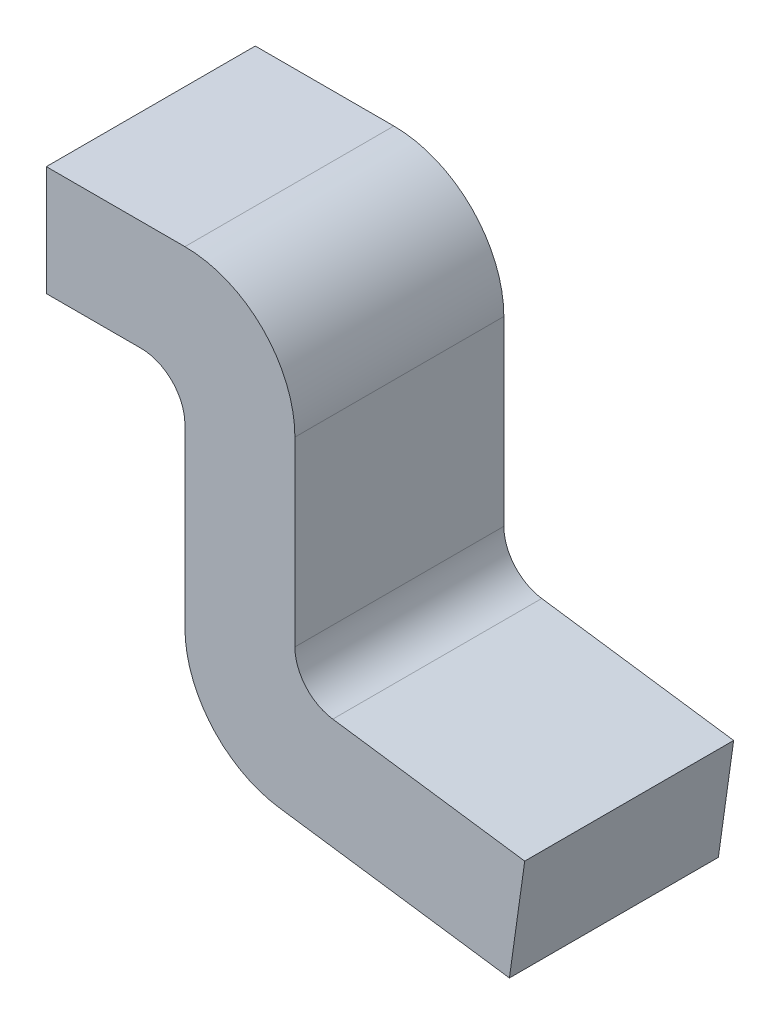
ISO-10303-21;
HEADER;
FILE_DESCRIPTION(('STEP AP214'),'2;1');
FILE_NAME('part.step','',(''),(''),'','','');
FILE_SCHEMA(('AUTOMOTIVE_DESIGN { 1 0 10303 214 1 1 1 1 }'));
ENDSEC;
DATA;
#1=APPLICATION_CONTEXT('core data for automotive mechanical design processes');
#2=APPLICATION_PROTOCOL_DEFINITION('international standard','automotive_design',2000,#1);
#3=PRODUCT_CONTEXT('',#1,'mechanical');
#4=PRODUCT('Part','Part','',(#3));
#5=PRODUCT_RELATED_PRODUCT_CATEGORY('part','',(#4));
#6=PRODUCT_DEFINITION_FORMATION('','',#4);
#7=PRODUCT_DEFINITION_CONTEXT('part definition',#1,'design');
#8=PRODUCT_DEFINITION('design','',#6,#7);
#9=PRODUCT_DEFINITION_SHAPE('','',#8);
#10=(LENGTH_UNIT() NAMED_UNIT(*) SI_UNIT(.MILLI.,.METRE.));
#11=(NAMED_UNIT(*) PLANE_ANGLE_UNIT() SI_UNIT($,.RADIAN.));
#12=(NAMED_UNIT(*) SI_UNIT($,.STERADIAN.) SOLID_ANGLE_UNIT());
#13=UNCERTAINTY_MEASURE_WITH_UNIT(LENGTH_MEASURE(1.E-05),#10,'distance_accuracy_value','');
#14=(GEOMETRIC_REPRESENTATION_CONTEXT(3) GLOBAL_UNCERTAINTY_ASSIGNED_CONTEXT((#13)) GLOBAL_UNIT_ASSIGNED_CONTEXT((#10,
#11,#12)) REPRESENTATION_CONTEXT('',''));
#15=CARTESIAN_POINT('',(0.,0.,0.));
#16=DIRECTION('',(0.,0.,1.));
#17=DIRECTION('',(1.,0.,0.));
#18=AXIS2_PLACEMENT_3D('',#15,#16,#17);
#19=CARTESIAN_POINT('',(0.675692646863,-0.546680467438,0.));
#20=DIRECTION('',(0.,0.,-1.));
#21=DIRECTION('',(-0.754709580222626,-0.656059028990675,0.));
#22=AXIS2_PLACEMENT_3D('',#19,#20,#21);
#23=CYLINDRICAL_SURFACE('',#22,0.1016);
#24=CARTESIAN_POINT('',(0.675692646863,-0.546680467438,0.2413));
#25=DIRECTION('',(0.,0.,1.));
#26=DIRECTION('',(-0.754709580222626,-0.656059028990675,0.));
#27=AXIS2_PLACEMENT_3D('',#24,#25,#26);
#28=CIRCLE('',#27,0.1016);
#29=CARTESIAN_POINT('',(0.574092646863,-0.546680467438,0.2413));
#30=VERTEX_POINT('',#29);
#31=CARTESIAN_POINT('',(0.661552659805,-0.647291703222,0.2413));
#32=VERTEX_POINT('',#31);
#33=EDGE_CURVE('E11',#30,#32,#28,.T.);
#34=ORIENTED_EDGE('',*,*,#33,.T.);
#35=DIRECTION('',(0.,0.,-1.));
#36=VECTOR('',#35,1.);
#37=CARTESIAN_POINT('',(0.661552659805,-0.647291703222,0.));
#38=LINE('',#37,#36);
#39=CARTESIAN_POINT('',(0.661552659805,-0.647291703222,-0.2413));
#40=VERTEX_POINT('',#39);
#41=EDGE_CURVE('E20',#32,#40,#38,.T.);
#42=ORIENTED_EDGE('',*,*,#41,.T.);
#43=CARTESIAN_POINT('',(0.675692646863,-0.546680467438,-0.2413));
#44=DIRECTION('',(0.,0.,-1.));
#45=DIRECTION('',(-0.754709580222626,-0.656059028990675,0.));
#46=AXIS2_PLACEMENT_3D('',#43,#44,#45);
#47=CIRCLE('',#46,0.1016);
#48=CARTESIAN_POINT('',(0.574092646863,-0.546680467438,-0.2413));
#49=VERTEX_POINT('',#48);
#50=EDGE_CURVE('E136',#40,#49,#47,.T.);
#51=ORIENTED_EDGE('',*,*,#50,.T.);
#52=DIRECTION('',(0.,0.,1.));
#53=VECTOR('',#52,1.);
#54=CARTESIAN_POINT('',(0.574092646863,-0.546680467438,0.));
#55=LINE('',#54,#53);
#56=EDGE_CURVE('E149',#49,#30,#55,.T.);
#57=ORIENTED_EDGE('',*,*,#56,.T.);
#58=EDGE_LOOP('',(#34,#42,#51,#57));
#59=FACE_BOUND('',#58,.T.);
#60=ADVANCED_FACE('F16',(#59),#23,.F.);
#61=CARTESIAN_POINT('',(1.1049,-0.709600108476,0.));
#62=DIRECTION('',(0.139173100959942,0.990268068741588,0.));
#63=DIRECTION('',(0.,0.,-1.));
#64=AXIS2_PLACEMENT_3D('',#61,#62,#63);
#65=PLANE('',#64);
#66=ORIENTED_EDGE('',*,*,#41,.F.);
#67=DIRECTION('',(-0.990268068741588,0.139173100959942,0.));
#68=VECTOR('',#67,1.);
#69=CARTESIAN_POINT('',(0.574092646863,-0.635,0.2413));
#70=LINE('',#69,#68);
#71=CARTESIAN_POINT('',(1.1049,-0.709600108476,0.2413));
#72=VERTEX_POINT('',#71);
#73=EDGE_CURVE('E144',#72,#32,#70,.T.);
#74=ORIENTED_EDGE('',*,*,#73,.F.);
#75=DIRECTION('',(0.,0.,-1.));
#76=VECTOR('',#75,1.);
#77=CARTESIAN_POINT('',(1.1049,-0.709600108476,0.));
#78=LINE('',#77,#76);
#79=CARTESIAN_POINT('',(1.1049,-0.709600108476,-0.2413));
#80=VERTEX_POINT('',#79);
#81=EDGE_CURVE('E141',#72,#80,#78,.T.);
#82=ORIENTED_EDGE('',*,*,#81,.T.);
#83=DIRECTION('',(0.990268068741588,-0.139173100959942,0.));
#84=VECTOR('',#83,1.);
#85=CARTESIAN_POINT('',(0.574092646863,-0.635,-0.2413));
#86=LINE('',#85,#84);
#87=EDGE_CURVE('E127',#40,#80,#86,.T.);
#88=ORIENTED_EDGE('',*,*,#87,.F.);
#89=EDGE_LOOP('',(#66,#74,#82,#88));
#90=FACE_BOUND('',#89,.T.);
#91=ADVANCED_FACE('F142',(#90),#65,.T.);
#92=CARTESIAN_POINT('',(0.218492646863,-0.2286,0.));
#93=DIRECTION('',(0.,0.,-1.));
#94=DIRECTION('',(0.707106781186548,0.707106781186548,0.));
#95=AXIS2_PLACEMENT_3D('',#92,#93,#94);
#96=CYLINDRICAL_SURFACE('',#95,0.1016);
#97=CARTESIAN_POINT('',(0.218492646863,-0.2286,0.2413));
#98=DIRECTION('',(0.,0.,1.));
#99=DIRECTION('',(0.707106781186548,0.707106781186548,0.));
#100=AXIS2_PLACEMENT_3D('',#97,#98,#99);
#101=CIRCLE('',#100,0.1016);
#102=CARTESIAN_POINT('',(0.320092646863,-0.2286,0.2413));
#103=VERTEX_POINT('',#102);
#104=CARTESIAN_POINT('',(0.218492646863,-0.127,0.2413));
#105=VERTEX_POINT('',#104);
#106=EDGE_CURVE('E150',#103,#105,#101,.T.);
#107=ORIENTED_EDGE('',*,*,#106,.T.);
#108=DIRECTION('',(0.,0.,-1.));
#109=VECTOR('',#108,1.);
#110=CARTESIAN_POINT('',(0.218492646863,-0.127,0.));
#111=LINE('',#110,#109);
#112=CARTESIAN_POINT('',(0.218492646863,-0.127,-0.2413));
#113=VERTEX_POINT('',#112);
#114=EDGE_CURVE('E222',#105,#113,#111,.T.);
#115=ORIENTED_EDGE('',*,*,#114,.T.);
#116=CARTESIAN_POINT('',(0.218492646863,-0.2286,-0.2413));
#117=DIRECTION('',(0.,0.,-1.));
#118=DIRECTION('',(0.707106781186548,0.707106781186548,0.));
#119=AXIS2_PLACEMENT_3D('',#116,#117,#118);
#120=CIRCLE('',#119,0.1016);
#121=CARTESIAN_POINT('',(0.320092646863,-0.2286,-0.2413));
#122=VERTEX_POINT('',#121);
#123=EDGE_CURVE('E236',#113,#122,#120,.T.);
#124=ORIENTED_EDGE('',*,*,#123,.T.);
#125=DIRECTION('',(0.,0.,1.));
#126=VECTOR('',#125,1.);
#127=CARTESIAN_POINT('',(0.320092646863,-0.2286,0.));
#128=LINE('',#127,#126);
#129=EDGE_CURVE('E216',#122,#103,#128,.T.);
#130=ORIENTED_EDGE('',*,*,#129,.T.);
#131=EDGE_LOOP('',(#107,#115,#124,#130));
#132=FACE_BOUND('',#131,.T.);
#133=ADVANCED_FACE('F18',(#132),#96,.F.);
#134=CARTESIAN_POINT('',(0.,-0.127,0.));
#135=DIRECTION('',(0.,-1.,0.));
#136=DIRECTION('',(0.,0.,-1.));
#137=AXIS2_PLACEMENT_3D('',#134,#135,#136);
#138=PLANE('',#137);
#139=ORIENTED_EDGE('',*,*,#114,.F.);
#140=DIRECTION('',(1.,0.,0.));
#141=VECTOR('',#140,1.);
#142=CARTESIAN_POINT('',(0.320092646863,-0.127,0.2413));
#143=LINE('',#142,#141);
#144=CARTESIAN_POINT('',(0.,-0.127,0.2413));
#145=VERTEX_POINT('',#144);
#146=EDGE_CURVE('E207',#145,#105,#143,.T.);
#147=ORIENTED_EDGE('',*,*,#146,.F.);
#148=DIRECTION('',(0.,0.,-1.));
#149=VECTOR('',#148,1.);
#150=CARTESIAN_POINT('',(0.,-0.127,0.));
#151=LINE('',#150,#149);
#152=CARTESIAN_POINT('',(0.,-0.127,-0.2413));
#153=VERTEX_POINT('',#152);
#154=EDGE_CURVE('E212',#145,#153,#151,.T.);
#155=ORIENTED_EDGE('',*,*,#154,.T.);
#156=DIRECTION('',(-1.,0.,0.));
#157=VECTOR('',#156,1.);
#158=CARTESIAN_POINT('',(0.320092646863,-0.127,-0.2413));
#159=LINE('',#158,#157);
#160=EDGE_CURVE('E171',#113,#153,#159,.T.);
#161=ORIENTED_EDGE('',*,*,#160,.F.);
#162=EDGE_LOOP('',(#139,#147,#155,#161));
#163=FACE_BOUND('',#162,.T.);
#164=ADVANCED_FACE('F255',(#163),#138,.T.);
#165=CARTESIAN_POINT('',(0.574092646863,-0.635,0.));
#166=DIRECTION('',(0.,0.,-1.));
#167=DIRECTION('',(-0.754709580222626,-0.656059028990675,0.));
#168=AXIS2_PLACEMENT_3D('',#165,#166,#167);
#169=CYLINDRICAL_SURFACE('',#168,0.254);
#170=CARTESIAN_POINT('',(0.574092646863,-0.635,-0.2413));
#171=DIRECTION('',(0.,0.,1.));
#172=DIRECTION('',(-0.754709580222626,-0.656059028990675,0.));
#173=AXIS2_PLACEMENT_3D('',#170,#171,#172);
#174=CIRCLE('',#173,0.254);
#175=CARTESIAN_POINT('',(0.320092646863,-0.635,-0.2413));
#176=VERTEX_POINT('',#175);
#177=CARTESIAN_POINT('',(0.538742679219,-0.88652808946,-0.2413));
#178=VERTEX_POINT('',#177);
#179=EDGE_CURVE('E217',#176,#178,#174,.T.);
#180=ORIENTED_EDGE('',*,*,#179,.T.);
#181=DIRECTION('',(0.,0.,1.));
#182=VECTOR('',#181,1.);
#183=CARTESIAN_POINT('',(0.538742679219,-0.88652808946,0.));
#184=LINE('',#183,#182);
#185=CARTESIAN_POINT('',(0.538742679219,-0.88652808946,0.2413));
#186=VERTEX_POINT('',#185);
#187=EDGE_CURVE('E186',#178,#186,#184,.T.);
#188=ORIENTED_EDGE('',*,*,#187,.T.);
#189=CARTESIAN_POINT('',(0.574092646863,-0.635,0.2413));
#190=DIRECTION('',(0.,0.,-1.));
#191=DIRECTION('',(-0.754709580222626,-0.656059028990675,0.));
#192=AXIS2_PLACEMENT_3D('',#189,#190,#191);
#193=CIRCLE('',#192,0.254);
#194=CARTESIAN_POINT('',(0.320092646863,-0.635,0.2413));
#195=VERTEX_POINT('',#194);
#196=EDGE_CURVE('E183',#186,#195,#193,.T.);
#197=ORIENTED_EDGE('',*,*,#196,.T.);
#198=DIRECTION('',(0.,0.,-1.));
#199=VECTOR('',#198,1.);
#200=CARTESIAN_POINT('',(0.320092646863,-0.635,0.));
#201=LINE('',#200,#199);
#202=EDGE_CURVE('E187',#195,#176,#201,.T.);
#203=ORIENTED_EDGE('',*,*,#202,.T.);
#204=EDGE_LOOP('',(#180,#188,#197,#203));
#205=FACE_BOUND('',#204,.T.);
#206=ADVANCED_FACE('F327',(#205),#169,.T.);
#207=CARTESIAN_POINT('',(0.320092646863,-0.855798831405,0.));
#208=DIRECTION('',(-0.139173100959942,-0.990268068741588,0.));
#209=DIRECTION('',(-0.990268068741588,0.139173100959942,0.));
#210=AXIS2_PLACEMENT_3D('',#207,#208,#209);
#211=PLANE('',#210);
#212=ORIENTED_EDGE('',*,*,#187,.F.);
#213=DIRECTION('',(-0.990268068741588,0.139173100959942,0.));
#214=VECTOR('',#213,1.);
#215=CARTESIAN_POINT('',(1.069550032356,-0.961128197936,-0.2413));
#216=LINE('',#215,#214);
#217=CARTESIAN_POINT('',(1.069550032356,-0.961128197936,-0.2413));
#218=VERTEX_POINT('',#217);
#219=EDGE_CURVE('E158',#218,#178,#216,.T.);
#220=ORIENTED_EDGE('',*,*,#219,.F.);
#221=DIRECTION('',(0.,0.,-1.));
#222=VECTOR('',#221,1.);
#223=CARTESIAN_POINT('',(1.069550032356,-0.961128197936,0.));
#224=LINE('',#223,#222);
#225=CARTESIAN_POINT('',(1.069550032356,-0.961128197936,0.2413));
#226=VERTEX_POINT('',#225);
#227=EDGE_CURVE('E155',#226,#218,#224,.T.);
#228=ORIENTED_EDGE('',*,*,#227,.F.);
#229=DIRECTION('',(0.990268068741588,-0.139173100959942,0.));
#230=VECTOR('',#229,1.);
#231=CARTESIAN_POINT('',(1.069550032356,-0.961128197936,0.2413));
#232=LINE('',#231,#230);
#233=EDGE_CURVE('E196',#186,#226,#232,.T.);
#234=ORIENTED_EDGE('',*,*,#233,.F.);
#235=EDGE_LOOP('',(#212,#220,#228,#234));
#236=FACE_BOUND('',#235,.T.);
#237=ADVANCED_FACE('F281',(#236),#211,.T.);
#238=CARTESIAN_POINT('',(0.510953388976,-0.425129121215,-0.2413));
#239=DIRECTION('',(0.,0.,-1.));
#240=DIRECTION('',(0.,-1.,0.));
#241=AXIS2_PLACEMENT_3D('',#238,#239,#240);
#242=PLANE('',#241);
#243=ORIENTED_EDGE('',*,*,#179,.F.);
#244=DIRECTION('',(0.,1.,0.));
#245=VECTOR('',#244,1.);
#246=CARTESIAN_POINT('',(0.320092646863,-0.855798831405,-0.2413));
#247=LINE('',#246,#245);
#248=EDGE_CURVE('E226',#176,#122,#247,.T.);
#249=ORIENTED_EDGE('',*,*,#248,.T.);
#250=ORIENTED_EDGE('',*,*,#123,.F.);
#251=ORIENTED_EDGE('',*,*,#160,.T.);
#252=DIRECTION('',(0.,1.,0.));
#253=VECTOR('',#252,1.);
#254=CARTESIAN_POINT('',(0.,-0.127,-0.2413));
#255=LINE('',#254,#253);
#256=CARTESIAN_POINT('',(0.,0.127,-0.2413));
#257=VERTEX_POINT('',#256);
#258=EDGE_CURVE('E168',#153,#257,#255,.T.);
#259=ORIENTED_EDGE('',*,*,#258,.T.);
#260=DIRECTION('',(1.,0.,0.));
#261=VECTOR('',#260,1.);
#262=CARTESIAN_POINT('',(0.,0.127,-0.2413));
#263=LINE('',#262,#261);
#264=CARTESIAN_POINT('',(0.320092646863,0.127,-0.2413));
#265=VERTEX_POINT('',#264);
#266=EDGE_CURVE('E110',#257,#265,#263,.T.);
#267=ORIENTED_EDGE('',*,*,#266,.T.);
#268=CARTESIAN_POINT('',(0.320092646863,-0.127,-0.2413));
#269=DIRECTION('',(0.,0.,1.));
#270=DIRECTION('',(0.707106781186548,0.707106781186548,0.));
#271=AXIS2_PLACEMENT_3D('',#268,#269,#270);
#272=CIRCLE('',#271,0.254);
#273=CARTESIAN_POINT('',(0.574092646863,-0.127,-0.2413));
#274=VERTEX_POINT('',#273);
#275=EDGE_CURVE('E98',#274,#265,#272,.T.);
#276=ORIENTED_EDGE('',*,*,#275,.F.);
#277=DIRECTION('',(0.,-1.,0.));
#278=VECTOR('',#277,1.);
#279=CARTESIAN_POINT('',(0.574092646863,0.127,-0.2413));
#280=LINE('',#279,#278);
#281=EDGE_CURVE('E138',#274,#49,#280,.T.);
#282=ORIENTED_EDGE('',*,*,#281,.T.);
#283=ORIENTED_EDGE('',*,*,#50,.F.);
#284=ORIENTED_EDGE('',*,*,#87,.T.);
#285=DIRECTION('',(-0.139173100959942,-0.990268068741588,0.));
#286=VECTOR('',#285,1.);
#287=CARTESIAN_POINT('',(1.1049,-0.709600108476,-0.2413));
#288=LINE('',#287,#286);
#289=EDGE_CURVE('E133',#80,#218,#288,.T.);
#290=ORIENTED_EDGE('',*,*,#289,.T.);
#291=ORIENTED_EDGE('',*,*,#219,.T.);
#292=EDGE_LOOP('',(#243,#249,#250,#251,#259,#267,#276,#282,#283,#284,#290,#291));
#293=FACE_BOUND('',#292,.T.);
#294=ADVANCED_FACE('F130',(#293),#242,.T.);
#295=CARTESIAN_POINT('',(0.320092646863,-0.127,0.));
#296=DIRECTION('',(0.,0.,-1.));
#297=DIRECTION('',(0.707106781186548,0.707106781186548,0.));
#298=AXIS2_PLACEMENT_3D('',#295,#296,#297);
#299=CYLINDRICAL_SURFACE('',#298,0.254);
#300=ORIENTED_EDGE('',*,*,#275,.T.);
#301=DIRECTION('',(0.,0.,1.));
#302=VECTOR('',#301,1.);
#303=CARTESIAN_POINT('',(0.320092646863,0.127,0.));
#304=LINE('',#303,#302);
#305=CARTESIAN_POINT('',(0.320092646863,0.127,0.2413));
#306=VERTEX_POINT('',#305);
#307=EDGE_CURVE('E176',#265,#306,#304,.T.);
#308=ORIENTED_EDGE('',*,*,#307,.T.);
#309=CARTESIAN_POINT('',(0.320092646863,-0.127,0.2413));
#310=DIRECTION('',(0.,0.,-1.));
#311=DIRECTION('',(0.707106781186548,0.707106781186548,0.));
#312=AXIS2_PLACEMENT_3D('',#309,#310,#311);
#313=CIRCLE('',#312,0.254);
#314=CARTESIAN_POINT('',(0.574092646863,-0.127,0.2413));
#315=VERTEX_POINT('',#314);
#316=EDGE_CURVE('E172',#306,#315,#313,.T.);
#317=ORIENTED_EDGE('',*,*,#316,.T.);
#318=DIRECTION('',(0.,0.,-1.));
#319=VECTOR('',#318,1.);
#320=CARTESIAN_POINT('',(0.574092646863,-0.127,0.));
#321=LINE('',#320,#319);
#322=EDGE_CURVE('E177',#315,#274,#321,.T.);
#323=ORIENTED_EDGE('',*,*,#322,.T.);
#324=EDGE_LOOP('',(#300,#308,#317,#323));
#325=FACE_BOUND('',#324,.T.);
#326=ADVANCED_FACE('F307',(#325),#299,.T.);
#327=CARTESIAN_POINT('',(0.574092646863,0.127,0.));
#328=DIRECTION('',(0.,1.,0.));
#329=DIRECTION('',(1.,0.,0.));
#330=AXIS2_PLACEMENT_3D('',#327,#328,#329);
#331=PLANE('',#330);
#332=ORIENTED_EDGE('',*,*,#307,.F.);
#333=ORIENTED_EDGE('',*,*,#266,.F.);
#334=DIRECTION('',(0.,0.,1.));
#335=VECTOR('',#334,1.);
#336=CARTESIAN_POINT('',(0.,0.127,0.));
#337=LINE('',#336,#335);
#338=CARTESIAN_POINT('',(0.,0.127,0.2413));
#339=VERTEX_POINT('',#338);
#340=EDGE_CURVE('E204',#257,#339,#337,.T.);
#341=ORIENTED_EDGE('',*,*,#340,.T.);
#342=DIRECTION('',(-1.,0.,0.));
#343=VECTOR('',#342,1.);
#344=CARTESIAN_POINT('',(0.,0.127,0.2413));
#345=LINE('',#344,#343);
#346=EDGE_CURVE('E178',#306,#339,#345,.T.);
#347=ORIENTED_EDGE('',*,*,#346,.F.);
#348=EDGE_LOOP('',(#332,#333,#341,#347));
#349=FACE_BOUND('',#348,.T.);
#350=ADVANCED_FACE('F308',(#349),#331,.T.);
#351=CARTESIAN_POINT('',(0.574092646863,-0.635,0.));
#352=DIRECTION('',(1.,0.,0.));
#353=DIRECTION('',(0.,-1.,0.));
#354=AXIS2_PLACEMENT_3D('',#351,#352,#353);
#355=PLANE('',#354);
#356=ORIENTED_EDGE('',*,*,#56,.F.);
#357=ORIENTED_EDGE('',*,*,#281,.F.);
#358=ORIENTED_EDGE('',*,*,#322,.F.);
#359=DIRECTION('',(0.,1.,0.));
#360=VECTOR('',#359,1.);
#361=CARTESIAN_POINT('',(0.574092646863,0.127,0.2413));
#362=LINE('',#361,#360);
#363=EDGE_CURVE('E181',#30,#315,#362,.T.);
#364=ORIENTED_EDGE('',*,*,#363,.F.);
#365=EDGE_LOOP('',(#356,#357,#358,#364));
#366=FACE_BOUND('',#365,.T.);
#367=ADVANCED_FACE('F306',(#366),#355,.T.);
#368=CARTESIAN_POINT('',(1.069550032356,-0.961128197936,0.));
#369=DIRECTION('',(0.990268068741588,-0.139173100959942,0.));
#370=DIRECTION('',(0.,0.,-1.));
#371=AXIS2_PLACEMENT_3D('',#368,#369,#370);
#372=PLANE('',#371);
#373=ORIENTED_EDGE('',*,*,#81,.F.);
#374=DIRECTION('',(0.139173100959942,0.990268068741588,0.));
#375=VECTOR('',#374,1.);
#376=CARTESIAN_POINT('',(1.1049,-0.709600108476,0.2413));
#377=LINE('',#376,#375);
#378=EDGE_CURVE('E194',#226,#72,#377,.T.);
#379=ORIENTED_EDGE('',*,*,#378,.F.);
#380=ORIENTED_EDGE('',*,*,#227,.T.);
#381=ORIENTED_EDGE('',*,*,#289,.F.);
#382=EDGE_LOOP('',(#373,#379,#380,#381));
#383=FACE_BOUND('',#382,.T.);
#384=ADVANCED_FACE('F153',(#383),#372,.T.);
#385=CARTESIAN_POINT('',(0.320092646863,-0.127,0.));
#386=DIRECTION('',(-1.,0.,0.));
#387=DIRECTION('',(0.,0.,1.));
#388=AXIS2_PLACEMENT_3D('',#385,#386,#387);
#389=PLANE('',#388);
#390=ORIENTED_EDGE('',*,*,#129,.F.);
#391=ORIENTED_EDGE('',*,*,#248,.F.);
#392=ORIENTED_EDGE('',*,*,#202,.F.);
#393=DIRECTION('',(0.,-1.,0.));
#394=VECTOR('',#393,1.);
#395=CARTESIAN_POINT('',(0.320092646863,-0.855798831405,0.2413));
#396=LINE('',#395,#394);
#397=EDGE_CURVE('E211',#103,#195,#396,.T.);
#398=ORIENTED_EDGE('',*,*,#397,.F.);
#399=EDGE_LOOP('',(#390,#391,#392,#398));
#400=FACE_BOUND('',#399,.T.);
#401=ADVANCED_FACE('F288',(#400),#389,.T.);
#402=CARTESIAN_POINT('',(0.,0.127,0.));
#403=DIRECTION('',(-1.,0.,0.));
#404=DIRECTION('',(0.,0.,1.));
#405=AXIS2_PLACEMENT_3D('',#402,#403,#404);
#406=PLANE('',#405);
#407=ORIENTED_EDGE('',*,*,#154,.F.);
#408=DIRECTION('',(0.,-1.,0.));
#409=VECTOR('',#408,1.);
#410=CARTESIAN_POINT('',(0.,-0.127,0.2413));
#411=LINE('',#410,#409);
#412=EDGE_CURVE('E182',#339,#145,#411,.T.);
#413=ORIENTED_EDGE('',*,*,#412,.F.);
#414=ORIENTED_EDGE('',*,*,#340,.F.);
#415=ORIENTED_EDGE('',*,*,#258,.F.);
#416=EDGE_LOOP('',(#407,#413,#414,#415));
#417=FACE_BOUND('',#416,.T.);
#418=ADVANCED_FACE('F251',(#417),#406,.T.);
#419=CARTESIAN_POINT('',(0.510953388976,-0.425129121215,0.2413));
#420=DIRECTION('',(0.,0.,1.));
#421=DIRECTION('',(1.,0.,0.));
#422=AXIS2_PLACEMENT_3D('',#419,#420,#421);
#423=PLANE('',#422);
#424=ORIENTED_EDGE('',*,*,#196,.F.);
#425=ORIENTED_EDGE('',*,*,#233,.T.);
#426=ORIENTED_EDGE('',*,*,#378,.T.);
#427=ORIENTED_EDGE('',*,*,#73,.T.);
#428=ORIENTED_EDGE('',*,*,#33,.F.);
#429=ORIENTED_EDGE('',*,*,#363,.T.);
#430=ORIENTED_EDGE('',*,*,#316,.F.);
#431=ORIENTED_EDGE('',*,*,#346,.T.);
#432=ORIENTED_EDGE('',*,*,#412,.T.);
#433=ORIENTED_EDGE('',*,*,#146,.T.);
#434=ORIENTED_EDGE('',*,*,#106,.F.);
#435=ORIENTED_EDGE('',*,*,#397,.T.);
#436=EDGE_LOOP('',(#424,#425,#426,#427,#428,#429,#430,#431,#432,#433,#434,#435));
#437=FACE_BOUND('',#436,.T.);
#438=ADVANCED_FACE('F245',(#437),#423,.T.);
#439=CLOSED_SHELL('',(#60,#91,#133,#164,#206,#237,#294,#326,#350,#367,#384,#401,#418,#438));
#440=MANIFOLD_SOLID_BREP('B1',#439);
#441=ADVANCED_BREP_SHAPE_REPRESENTATION('',(#18,#440),#14);
#442=SHAPE_DEFINITION_REPRESENTATION(#9,#441);
ENDSEC;
END-ISO-10303-21;
